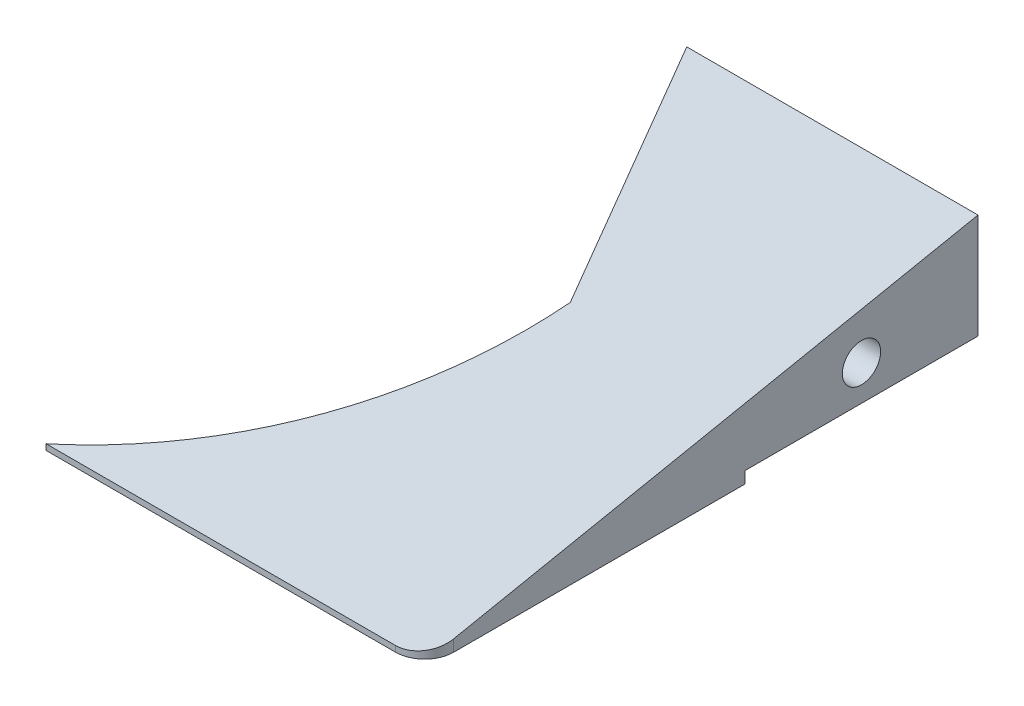
ISO-10303-21;
HEADER;
FILE_DESCRIPTION(('STEP AP214'),'2;1');
FILE_NAME('part.step','',(''),(''),'','','');
FILE_SCHEMA(('AUTOMOTIVE_DESIGN { 1 0 10303 214 1 1 1 1 }'));
ENDSEC;
DATA;
#1=APPLICATION_CONTEXT('core data for automotive mechanical design processes');
#2=APPLICATION_PROTOCOL_DEFINITION('international standard','automotive_design',2000,#1);
#3=PRODUCT_CONTEXT('',#1,'mechanical');
#4=PRODUCT('Part','Part','',(#3));
#5=PRODUCT_RELATED_PRODUCT_CATEGORY('part','',(#4));
#6=PRODUCT_DEFINITION_FORMATION('','',#4);
#7=PRODUCT_DEFINITION_CONTEXT('part definition',#1,'design');
#8=PRODUCT_DEFINITION('design','',#6,#7);
#9=PRODUCT_DEFINITION_SHAPE('','',#8);
#10=(LENGTH_UNIT() NAMED_UNIT(*) SI_UNIT(.MILLI.,.METRE.));
#11=(NAMED_UNIT(*) PLANE_ANGLE_UNIT() SI_UNIT($,.RADIAN.));
#12=(NAMED_UNIT(*) SI_UNIT($,.STERADIAN.) SOLID_ANGLE_UNIT());
#13=UNCERTAINTY_MEASURE_WITH_UNIT(LENGTH_MEASURE(1.E-05),#10,'distance_accuracy_value','');
#14=(GEOMETRIC_REPRESENTATION_CONTEXT(3) GLOBAL_UNCERTAINTY_ASSIGNED_CONTEXT((#13)) GLOBAL_UNIT_ASSIGNED_CONTEXT((#10,
#11,#12)) REPRESENTATION_CONTEXT('',''));
#15=CARTESIAN_POINT('',(0.,0.,0.));
#16=DIRECTION('',(0.,0.,1.));
#17=DIRECTION('',(1.,0.,0.));
#18=AXIS2_PLACEMENT_3D('',#15,#16,#17);
#19=CARTESIAN_POINT('',(-65.,-10.,95.));
#20=DIRECTION('',(0.,1.,0.));
#21=DIRECTION('',(0.,0.,1.));
#22=AXIS2_PLACEMENT_3D('',#19,#20,#21);
#23=PLANE('',#22);
#24=DIRECTION('',(-1.,0.,0.));
#25=VECTOR('',#24,1.);
#26=CARTESIAN_POINT('',(65.,-10.,40.));
#27=LINE('',#26,#25);
#28=CARTESIAN_POINT('',(65.,-10.,40.));
#29=VERTEX_POINT('',#28);
#30=CARTESIAN_POINT('',(35.,-10.,40.));
#31=VERTEX_POINT('',#30);
#32=EDGE_CURVE('E107',#29,#31,#27,.T.);
#33=ORIENTED_EDGE('',*,*,#32,.F.);
#34=DIRECTION('',(0.,0.,-1.));
#35=VECTOR('',#34,1.);
#36=CARTESIAN_POINT('',(65.,-10.,95.));
#37=LINE('',#36,#35);
#38=CARTESIAN_POINT('',(65.,-10.,90.));
#39=VERTEX_POINT('',#38);
#40=EDGE_CURVE('E117',#39,#29,#37,.T.);
#41=ORIENTED_EDGE('',*,*,#40,.F.);
#42=CARTESIAN_POINT('',(60.,-10.,90.));
#43=DIRECTION('',(0.,1.,0.));
#44=DIRECTION('',(0.,0.,1.));
#45=AXIS2_PLACEMENT_3D('',#42,#43,#44);
#46=CIRCLE('',#45,5.);
#47=CARTESIAN_POINT('',(60.,-10.,95.));
#48=VERTEX_POINT('',#47);
#49=EDGE_CURVE('E11',#39,#48,#46,.F.);
#50=ORIENTED_EDGE('',*,*,#49,.T.);
#51=DIRECTION('',(1.,0.,0.));
#52=VECTOR('',#51,1.);
#53=CARTESIAN_POINT('',(-65.,-10.,95.));
#54=LINE('',#53,#52);
#55=CARTESIAN_POINT('',(0.,-10.,95.));
#56=VERTEX_POINT('',#55);
#57=EDGE_CURVE('E124',#56,#48,#54,.T.);
#58=ORIENTED_EDGE('',*,*,#57,.F.);
#59=CARTESIAN_POINT('',(-38.0494612088023,-10.,32.1503428671258));
#60=DIRECTION('',(0.,1.,0.));
#61=DIRECTION('',(0.,0.,1.));
#62=AXIS2_PLACEMENT_3D('',#59,#60,#61);
#63=CIRCLE('',#62,73.47);
#64=EDGE_CURVE('E120',#31,#56,#63,.F.);
#65=ORIENTED_EDGE('',*,*,#64,.F.);
#66=EDGE_LOOP('',(#33,#41,#50,#58,#65));
#67=FACE_BOUND('',#66,.T.);
#68=ADVANCED_FACE('F37',(#67),#23,.F.);
#69=CARTESIAN_POINT('',(65.,10.,95.));
#70=DIRECTION('',(-1.,0.,0.));
#71=DIRECTION('',(0.,0.,1.));
#72=AXIS2_PLACEMENT_3D('',#69,#70,#71);
#73=PLANE('',#72);
#74=CARTESIAN_POINT('',(65.,-1.945,20.));
#75=DIRECTION('',(1.,0.,0.));
#76=DIRECTION('',(0.,0.,-1.));
#77=AXIS2_PLACEMENT_3D('',#74,#75,#76);
#78=CIRCLE('',#77,3.2899985);
#79=CARTESIAN_POINT('',(65.,-1.945,16.7100015));
#80=VERTEX_POINT('',#79);
#81=EDGE_CURVE('E154',#80,#80,#78,.T.);
#82=ORIENTED_EDGE('',*,*,#81,.F.);
#83=EDGE_LOOP('',(#82));
#84=FACE_BOUND('',#83,.T.);
#85=DIRECTION('',(0.,-1.,0.));
#86=VECTOR('',#85,1.);
#87=CARTESIAN_POINT('',(65.,-8.00000000000001,40.));
#88=LINE('',#87,#86);
#89=CARTESIAN_POINT('',(65.,-8.00000000000001,40.));
#90=VERTEX_POINT('',#89);
#91=EDGE_CURVE('E104',#90,#29,#88,.T.);
#92=ORIENTED_EDGE('',*,*,#91,.F.);
#93=DIRECTION('',(0.,0.,-1.));
#94=VECTOR('',#93,1.);
#95=CARTESIAN_POINT('',(65.,-8.00000000000001,40.));
#96=LINE('',#95,#94);
#97=CARTESIAN_POINT('',(65.,-8.00000000000001,0.));
#98=VERTEX_POINT('',#97);
#99=EDGE_CURVE('E313',#90,#98,#96,.T.);
#100=ORIENTED_EDGE('',*,*,#99,.T.);
#101=DIRECTION('',(0.,1.,0.));
#102=VECTOR('',#101,1.);
#103=CARTESIAN_POINT('',(65.,10.,0.));
#104=LINE('',#103,#102);
#105=CARTESIAN_POINT('',(65.,9.99999999999998,0.));
#106=VERTEX_POINT('',#105);
#107=EDGE_CURVE('E166',#98,#106,#104,.T.);
#108=ORIENTED_EDGE('',*,*,#107,.T.);
#109=DIRECTION('',(0.,-0.196116135138184,0.98058067569092));
#110=VECTOR('',#109,1.);
#111=CARTESIAN_POINT('',(65.,-8.26923076923078,91.3461538461539));
#112=LINE('',#111,#110);
#113=CARTESIAN_POINT('',(65.,-8.00000000000001,90.));
#114=VERTEX_POINT('',#113);
#115=EDGE_CURVE('E151',#106,#114,#112,.T.);
#116=ORIENTED_EDGE('',*,*,#115,.T.);
#117=DIRECTION('',(0.,1.,0.));
#118=VECTOR('',#117,1.);
#119=CARTESIAN_POINT('',(65.,-10.,90.));
#120=LINE('',#119,#118);
#121=EDGE_CURVE('E45',#114,#39,#120,.F.);
#122=ORIENTED_EDGE('',*,*,#121,.T.);
#123=ORIENTED_EDGE('',*,*,#40,.T.);
#124=EDGE_LOOP('',(#92,#100,#108,#116,#122,#123));
#125=FACE_BOUND('',#124,.T.);
#126=ADVANCED_FACE('F122',(#84,#125),#73,.F.);
#127=CARTESIAN_POINT('',(0.,0.,95.));
#128=DIRECTION('',(0.,0.,1.));
#129=DIRECTION('',(1.,0.,0.));
#130=AXIS2_PLACEMENT_3D('',#127,#128,#129);
#131=PLANE('',#130);
#132=ORIENTED_EDGE('',*,*,#57,.T.);
#133=DIRECTION('',(0.,1.,0.));
#134=VECTOR('',#133,1.);
#135=CARTESIAN_POINT('',(60.,-9.,95.));
#136=LINE('',#135,#134);
#137=CARTESIAN_POINT('',(60.,-9.,95.));
#138=VERTEX_POINT('',#137);
#139=EDGE_CURVE('E127',#48,#138,#136,.T.);
#140=ORIENTED_EDGE('',*,*,#139,.T.);
#141=DIRECTION('',(-1.,0.,0.));
#142=VECTOR('',#141,1.);
#143=CARTESIAN_POINT('',(211.041518069349,-8.99999999999995,95.));
#144=LINE('',#143,#142);
#145=CARTESIAN_POINT('',(0.,-9.00000000000002,95.));
#146=VERTEX_POINT('',#145);
#147=EDGE_CURVE('E141',#138,#146,#144,.T.);
#148=ORIENTED_EDGE('',*,*,#147,.T.);
#149=DIRECTION('',(0.,1.,0.));
#150=VECTOR('',#149,1.);
#151=CARTESIAN_POINT('',(0.,-10.001,95.));
#152=LINE('',#151,#150);
#153=EDGE_CURVE('E159',#56,#146,#152,.T.);
#154=ORIENTED_EDGE('',*,*,#153,.F.);
#155=EDGE_LOOP('',(#132,#140,#148,#154));
#156=FACE_BOUND('',#155,.T.);
#157=ADVANCED_FACE('F139',(#156),#131,.T.);
#158=CARTESIAN_POINT('',(0.,0.,0.));
#159=DIRECTION('',(0.,0.,1.));
#160=DIRECTION('',(1.,0.,0.));
#161=AXIS2_PLACEMENT_3D('',#158,#159,#160);
#162=PLANE('',#161);
#163=ORIENTED_EDGE('',*,*,#107,.F.);
#164=DIRECTION('',(1.,0.,0.));
#165=VECTOR('',#164,1.);
#166=CARTESIAN_POINT('',(15.,-8.,0.));
#167=LINE('',#166,#165);
#168=CARTESIAN_POINT('',(15.,-8.,0.));
#169=VERTEX_POINT('',#168);
#170=EDGE_CURVE('E113',#169,#98,#167,.T.);
#171=ORIENTED_EDGE('',*,*,#170,.F.);
#172=DIRECTION('',(0.,1.,0.));
#173=VECTOR('',#172,1.);
#174=CARTESIAN_POINT('',(15.,-10.001,0.));
#175=LINE('',#174,#173);
#176=CARTESIAN_POINT('',(15.,9.99999999999997,0.));
#177=VERTEX_POINT('',#176);
#178=EDGE_CURVE('E164',#169,#177,#175,.T.);
#179=ORIENTED_EDGE('',*,*,#178,.T.);
#180=DIRECTION('',(-1.,0.,0.));
#181=VECTOR('',#180,1.);
#182=CARTESIAN_POINT('',(-65.,10.,0.));
#183=LINE('',#182,#181);
#184=EDGE_CURVE('E130',#106,#177,#183,.T.);
#185=ORIENTED_EDGE('',*,*,#184,.F.);
#186=EDGE_LOOP('',(#163,#171,#179,#185));
#187=FACE_BOUND('',#186,.T.);
#188=ADVANCED_FACE('F198',(#187),#162,.F.);
#189=CARTESIAN_POINT('',(35.,-10.001,40.));
#190=DIRECTION('',(0.894427190999916,0.,-0.447213595499958));
#191=DIRECTION('',(-0.447213595499958,0.,-0.894427190999916));
#192=AXIS2_PLACEMENT_3D('',#189,#190,#191);
#193=PLANE('',#192);
#194=CARTESIAN_POINT('',(23.9442719099992,-1.945,17.8885438199983));
#195=DIRECTION('',(-0.894427190999916,0.,0.447213595499958));
#196=DIRECTION('',(0.447213595499958,0.,0.894427190999916));
#197=AXIS2_PLACEMENT_3D('',#194,#195,#196);
#198=CIRCLE('',#197,3.28999849999999);
#199=CARTESIAN_POINT('',(25.4156039683736,-1.945,20.8312079367473));
#200=VERTEX_POINT('',#199);
#201=EDGE_CURVE('E306',#200,#200,#198,.T.);
#202=ORIENTED_EDGE('',*,*,#201,.F.);
#203=EDGE_LOOP('',(#202));
#204=FACE_BOUND('',#203,.T.);
#205=ORIENTED_EDGE('',*,*,#178,.F.);
#206=DIRECTION('',(0.447213595499958,0.,0.894427190999916));
#207=VECTOR('',#206,1.);
#208=CARTESIAN_POINT('',(35.,-8.,40.));
#209=LINE('',#208,#207);
#210=CARTESIAN_POINT('',(35.,-8.,40.));
#211=VERTEX_POINT('',#210);
#212=EDGE_CURVE('E176',#169,#211,#209,.T.);
#213=ORIENTED_EDGE('',*,*,#212,.T.);
#214=DIRECTION('',(0.,1.,0.));
#215=VECTOR('',#214,1.);
#216=CARTESIAN_POINT('',(35.,-10.001,40.));
#217=LINE('',#216,#215);
#218=CARTESIAN_POINT('',(35.,1.99999999999998,40.));
#219=VERTEX_POINT('',#218);
#220=EDGE_CURVE('E161',#211,#219,#217,.T.);
#221=ORIENTED_EDGE('',*,*,#220,.T.);
#222=DIRECTION('',(-0.440225453162812,0.176090181265125,-0.880450906325624));
#223=VECTOR('',#222,1.);
#224=CARTESIAN_POINT('',(35.9303100775194,1.62787596899223,41.8606201550388));
#225=LINE('',#224,#223);
#226=EDGE_CURVE('E147',#219,#177,#225,.T.);
#227=ORIENTED_EDGE('',*,*,#226,.T.);
#228=EDGE_LOOP('',(#205,#213,#221,#227));
#229=FACE_BOUND('',#228,.T.);
#230=ADVANCED_FACE('F173',(#204,#229),#193,.F.);
#231=CARTESIAN_POINT('',(-38.0494612088023,-10.001,32.1503428671258));
#232=DIRECTION('',(0.,1.,0.));
#233=DIRECTION('',(0.,0.,1.));
#234=AXIS2_PLACEMENT_3D('',#231,#232,#233);
#235=CYLINDRICAL_SURFACE('',#234,73.47);
#236=ORIENTED_EDGE('',*,*,#153,.T.);
#237=CARTESIAN_POINT('',(-38.0494612088023,3.56993142657479,32.1503428671258));
#238=DIRECTION('',(0.,-0.98058067569092,-0.196116135138184));
#239=DIRECTION('',(0.,0.196116135138184,-0.98058067569092));
#240=AXIS2_PLACEMENT_3D('',#237,#238,#239);
#241=ELLIPSE('',#240,74.9249927327324,73.47);
#242=EDGE_CURVE('E123',#146,#219,#241,.F.);
#243=ORIENTED_EDGE('',*,*,#242,.T.);
#244=ORIENTED_EDGE('',*,*,#220,.F.);
#245=EDGE_CURVE('E162',#31,#211,#217,.T.);
#246=ORIENTED_EDGE('',*,*,#245,.F.);
#247=ORIENTED_EDGE('',*,*,#64,.T.);
#248=EDGE_LOOP('',(#236,#243,#244,#246,#247));
#249=FACE_BOUND('',#248,.T.);
#250=ADVANCED_FACE('F178',(#249),#235,.F.);
#251=CARTESIAN_POINT('',(211.041518069349,10.,0.));
#252=DIRECTION('',(0.,-0.98058067569092,-0.196116135138184));
#253=DIRECTION('',(0.,0.196116135138184,-0.98058067569092));
#254=AXIS2_PLACEMENT_3D('',#251,#252,#253);
#255=PLANE('',#254);
#256=ORIENTED_EDGE('',*,*,#147,.F.);
#257=CARTESIAN_POINT('',(60.,-8.,90.));
#258=DIRECTION('',(0.,-0.98058067569092,-0.196116135138184));
#259=DIRECTION('',(0.,-0.196116135138184,0.98058067569092));
#260=AXIS2_PLACEMENT_3D('',#257,#258,#259);
#261=ELLIPSE('',#260,5.09901951359278,5.);
#262=EDGE_CURVE('E59',#138,#114,#261,.F.);
#263=ORIENTED_EDGE('',*,*,#262,.T.);
#264=ORIENTED_EDGE('',*,*,#115,.F.);
#265=ORIENTED_EDGE('',*,*,#184,.T.);
#266=ORIENTED_EDGE('',*,*,#226,.F.);
#267=ORIENTED_EDGE('',*,*,#242,.F.);
#268=EDGE_LOOP('',(#256,#263,#264,#265,#266,#267));
#269=FACE_BOUND('',#268,.T.);
#270=ADVANCED_FACE('F144',(#269),#255,.F.);
#271=CARTESIAN_POINT('',(55.,-1.945,20.));
#272=DIRECTION('',(1.,0.,0.));
#273=DIRECTION('',(0.,0.,-1.));
#274=AXIS2_PLACEMENT_3D('',#271,#272,#273);
#275=CONICAL_SURFACE('',#274,3.2899985,1.02974425867665);
#276=CARTESIAN_POINT('',(53.0231694646903,-1.945,20.));
#277=VERTEX_POINT('',#276);
#278=VERTEX_LOOP('',#277);
#279=FACE_BOUND('',#278,.T.);
#280=CARTESIAN_POINT('',(55.,-1.945,20.));
#281=DIRECTION('',(1.,0.,0.));
#282=DIRECTION('',(0.,0.,-1.));
#283=AXIS2_PLACEMENT_3D('',#280,#281,#282);
#284=CIRCLE('',#283,3.2899985);
#285=CARTESIAN_POINT('',(55.,-1.945,16.7100015));
#286=VERTEX_POINT('',#285);
#287=EDGE_CURVE('E148',#286,#286,#284,.T.);
#288=ORIENTED_EDGE('',*,*,#287,.T.);
#289=EDGE_LOOP('',(#288));
#290=FACE_BOUND('',#289,.T.);
#291=ADVANCED_FACE('F210',(#279,#290),#275,.F.);
#292=CARTESIAN_POINT('',(65.,-1.945,20.));
#293=DIRECTION('',(1.,0.,0.));
#294=DIRECTION('',(0.,0.,-1.));
#295=AXIS2_PLACEMENT_3D('',#292,#293,#294);
#296=CYLINDRICAL_SURFACE('',#295,3.2899985);
#297=ORIENTED_EDGE('',*,*,#287,.F.);
#298=EDGE_LOOP('',(#297));
#299=FACE_BOUND('',#298,.T.);
#300=ORIENTED_EDGE('',*,*,#81,.T.);
#301=EDGE_LOOP('',(#300));
#302=FACE_BOUND('',#301,.T.);
#303=ADVANCED_FACE('F213',(#299,#302),#296,.F.);
#304=CARTESIAN_POINT('',(32.8885438199983,-1.945,13.4164078649987));
#305=DIRECTION('',(-0.894427190999916,0.,0.447213595499958));
#306=DIRECTION('',(0.447213595499958,0.,0.894427190999916));
#307=AXIS2_PLACEMENT_3D('',#304,#305,#306);
#308=CONICAL_SURFACE('',#307,3.28999849999999,1.02974425867665);
#309=CARTESIAN_POINT('',(34.6566748027783,-1.945,12.5323423736088));
#310=VERTEX_POINT('',#309);
#311=VERTEX_LOOP('',#310);
#312=FACE_BOUND('',#311,.T.);
#313=CARTESIAN_POINT('',(32.8885438199983,-1.945,13.4164078649987));
#314=DIRECTION('',(-0.894427190999916,0.,0.447213595499958));
#315=DIRECTION('',(0.447213595499958,0.,0.894427190999916));
#316=AXIS2_PLACEMENT_3D('',#313,#314,#315);
#317=CIRCLE('',#316,3.28999849999999);
#318=CARTESIAN_POINT('',(34.3598758783728,-1.945,16.3590719817477));
#319=VERTEX_POINT('',#318);
#320=EDGE_CURVE('E305',#319,#319,#317,.T.);
#321=ORIENTED_EDGE('',*,*,#320,.T.);
#322=EDGE_LOOP('',(#321));
#323=FACE_BOUND('',#322,.T.);
#324=ADVANCED_FACE('F188',(#312,#323),#308,.F.);
#325=CARTESIAN_POINT('',(23.9442719099992,-1.945,17.8885438199983));
#326=DIRECTION('',(-0.894427190999916,0.,0.447213595499958));
#327=DIRECTION('',(0.447213595499958,0.,0.894427190999916));
#328=AXIS2_PLACEMENT_3D('',#325,#326,#327);
#329=CYLINDRICAL_SURFACE('',#328,3.28999849999999);
#330=ORIENTED_EDGE('',*,*,#320,.F.);
#331=EDGE_LOOP('',(#330));
#332=FACE_BOUND('',#331,.T.);
#333=ORIENTED_EDGE('',*,*,#201,.T.);
#334=EDGE_LOOP('',(#333));
#335=FACE_BOUND('',#334,.T.);
#336=ADVANCED_FACE('F181',(#332,#335),#329,.F.);
#337=CARTESIAN_POINT('',(60.,0.,90.));
#338=DIRECTION('',(0.,-1.,0.));
#339=DIRECTION('',(0.,0.,-1.));
#340=AXIS2_PLACEMENT_3D('',#337,#338,#339);
#341=CYLINDRICAL_SURFACE('',#340,5.);
#342=ORIENTED_EDGE('',*,*,#49,.F.);
#343=ORIENTED_EDGE('',*,*,#121,.F.);
#344=ORIENTED_EDGE('',*,*,#262,.F.);
#345=ORIENTED_EDGE('',*,*,#139,.F.);
#346=EDGE_LOOP('',(#342,#343,#344,#345));
#347=FACE_BOUND('',#346,.T.);
#348=ADVANCED_FACE('F39',(#347),#341,.T.);
#349=CARTESIAN_POINT('',(15.,-8.,40.));
#350=DIRECTION('',(0.,1.,0.));
#351=DIRECTION('',(-1.,0.,0.));
#352=AXIS2_PLACEMENT_3D('',#349,#350,#351);
#353=PLANE('',#352);
#354=ORIENTED_EDGE('',*,*,#170,.T.);
#355=ORIENTED_EDGE('',*,*,#99,.F.);
#356=DIRECTION('',(1.,0.,0.));
#357=VECTOR('',#356,1.);
#358=CARTESIAN_POINT('',(15.,-8.,40.));
#359=LINE('',#358,#357);
#360=EDGE_CURVE('E110',#211,#90,#359,.T.);
#361=ORIENTED_EDGE('',*,*,#360,.F.);
#362=ORIENTED_EDGE('',*,*,#212,.F.);
#363=EDGE_LOOP('',(#354,#355,#361,#362));
#364=FACE_BOUND('',#363,.T.);
#365=ADVANCED_FACE('F180',(#364),#353,.F.);
#366=CARTESIAN_POINT('',(0.,0.,40.));
#367=DIRECTION('',(0.,0.,-1.));
#368=DIRECTION('',(-1.,0.,0.));
#369=AXIS2_PLACEMENT_3D('',#366,#367,#368);
#370=PLANE('',#369);
#371=ORIENTED_EDGE('',*,*,#245,.T.);
#372=ORIENTED_EDGE('',*,*,#360,.T.);
#373=ORIENTED_EDGE('',*,*,#91,.T.);
#374=ORIENTED_EDGE('',*,*,#32,.T.);
#375=EDGE_LOOP('',(#371,#372,#373,#374));
#376=FACE_BOUND('',#375,.T.);
#377=ADVANCED_FACE('F106',(#376),#370,.T.);
#378=CLOSED_SHELL('',(#68,#126,#157,#188,#230,#250,#270,#291,#303,#324,#336,#348,#365,#377));
#379=MANIFOLD_SOLID_BREP('B2',#378);
#380=ADVANCED_BREP_SHAPE_REPRESENTATION('',(#18,#379),#14);
#381=SHAPE_DEFINITION_REPRESENTATION(#9,#380);
ENDSEC;
END-ISO-10303-21;
